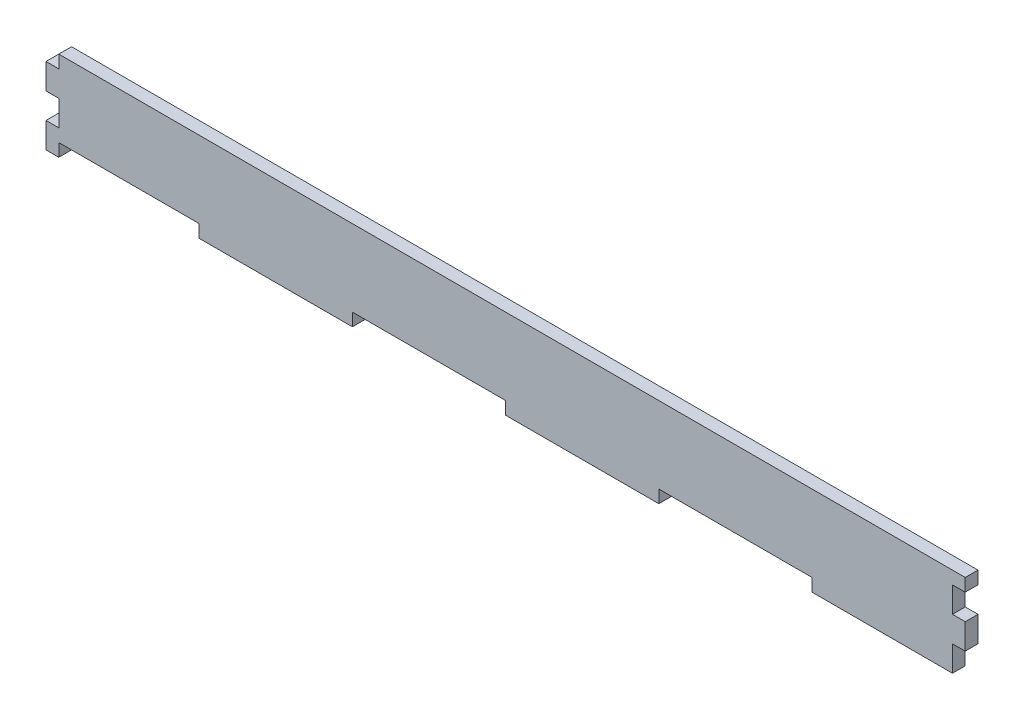
ISO-10303-21;
HEADER;
FILE_DESCRIPTION(('STEP AP214'),'2;1');
FILE_NAME('part.step','',(''),(''),'','','');
FILE_SCHEMA(('AUTOMOTIVE_DESIGN { 1 0 10303 214 1 1 1 1 }'));
ENDSEC;
DATA;
#1=APPLICATION_CONTEXT('core data for automotive mechanical design processes');
#2=APPLICATION_PROTOCOL_DEFINITION('international standard','automotive_design',2000,#1);
#3=PRODUCT_CONTEXT('',#1,'mechanical');
#4=PRODUCT('Part','Part','',(#3));
#5=PRODUCT_RELATED_PRODUCT_CATEGORY('part','',(#4));
#6=PRODUCT_DEFINITION_FORMATION('','',#4);
#7=PRODUCT_DEFINITION_CONTEXT('part definition',#1,'design');
#8=PRODUCT_DEFINITION('design','',#6,#7);
#9=PRODUCT_DEFINITION_SHAPE('','',#8);
#10=(LENGTH_UNIT() NAMED_UNIT(*) SI_UNIT(.MILLI.,.METRE.));
#11=(NAMED_UNIT(*) PLANE_ANGLE_UNIT() SI_UNIT($,.RADIAN.));
#12=(NAMED_UNIT(*) SI_UNIT($,.STERADIAN.) SOLID_ANGLE_UNIT());
#13=UNCERTAINTY_MEASURE_WITH_UNIT(LENGTH_MEASURE(1.E-05),#10,'distance_accuracy_value','');
#14=(GEOMETRIC_REPRESENTATION_CONTEXT(3) GLOBAL_UNCERTAINTY_ASSIGNED_CONTEXT((#13)) GLOBAL_UNIT_ASSIGNED_CONTEXT((#10,
#11,#12)) REPRESENTATION_CONTEXT('',''));
#15=CARTESIAN_POINT('',(0.,0.,0.));
#16=DIRECTION('',(0.,0.,1.));
#17=DIRECTION('',(1.,0.,0.));
#18=AXIS2_PLACEMENT_3D('',#15,#16,#17);
#19=CARTESIAN_POINT('',(111.125,-3.40005801291455E-12,3.175));
#20=DIRECTION('',(1.,0.,0.));
#21=DIRECTION('',(0.,1.,0.));
#22=AXIS2_PLACEMENT_3D('',#19,#20,#21);
#23=PLANE('',#22);
#24=DIRECTION('',(0.,-1.,0.));
#25=VECTOR('',#24,1.);
#26=CARTESIAN_POINT('',(111.125,-3.40005801291455E-12,0.));
#27=LINE('',#26,#25);
#28=CARTESIAN_POINT('',(111.125,-6.35,0.));
#29=VERTEX_POINT('',#28);
#30=CARTESIAN_POINT('',(111.125,-12.7,0.));
#31=VERTEX_POINT('',#30);
#32=EDGE_CURVE('E254',#29,#31,#27,.T.);
#33=ORIENTED_EDGE('',*,*,#32,.F.);
#34=DIRECTION('',(0.,0.,-1.));
#35=VECTOR('',#34,1.);
#36=CARTESIAN_POINT('',(111.125,-6.35,3.175));
#37=LINE('',#36,#35);
#38=CARTESIAN_POINT('',(111.125,-6.35,3.175));
#39=VERTEX_POINT('',#38);
#40=EDGE_CURVE('E11',#39,#29,#37,.T.);
#41=ORIENTED_EDGE('',*,*,#40,.F.);
#42=DIRECTION('',(0.,-1.,0.));
#43=VECTOR('',#42,1.);
#44=CARTESIAN_POINT('',(111.125,-3.40005801291455E-12,3.175));
#45=LINE('',#44,#43);
#46=CARTESIAN_POINT('',(111.125,-12.7,3.175));
#47=VERTEX_POINT('',#46);
#48=EDGE_CURVE('E322',#39,#47,#45,.T.);
#49=ORIENTED_EDGE('',*,*,#48,.T.);
#50=DIRECTION('',(0.,0.,-1.));
#51=VECTOR('',#50,1.);
#52=CARTESIAN_POINT('',(111.125,-12.7,3.175));
#53=LINE('',#52,#51);
#54=EDGE_CURVE('E148',#47,#31,#53,.T.);
#55=ORIENTED_EDGE('',*,*,#54,.T.);
#56=EDGE_LOOP('',(#33,#41,#49,#55));
#57=FACE_BOUND('',#56,.T.);
#58=ADVANCED_FACE('F38',(#57),#23,.T.);
#59=CARTESIAN_POINT('',(0.,-6.34999999999997,3.175));
#60=DIRECTION('',(0.,-1.,0.));
#61=DIRECTION('',(1.,0.,0.));
#62=AXIS2_PLACEMENT_3D('',#59,#60,#61);
#63=PLANE('',#62);
#64=DIRECTION('',(-1.,0.,0.));
#65=VECTOR('',#64,1.);
#66=CARTESIAN_POINT('',(0.,-6.34999999999997,0.));
#67=LINE('',#66,#65);
#68=CARTESIAN_POINT('',(114.3,-6.35,0.));
#69=VERTEX_POINT('',#68);
#70=EDGE_CURVE('E257',#69,#29,#67,.T.);
#71=ORIENTED_EDGE('',*,*,#70,.F.);
#72=DIRECTION('',(0.,0.,-1.));
#73=VECTOR('',#72,1.);
#74=CARTESIAN_POINT('',(114.3,-6.35,3.175));
#75=LINE('',#74,#73);
#76=CARTESIAN_POINT('',(114.3,-6.35,3.175));
#77=VERTEX_POINT('',#76);
#78=EDGE_CURVE('E46',#77,#69,#75,.T.);
#79=ORIENTED_EDGE('',*,*,#78,.F.);
#80=DIRECTION('',(-1.,0.,0.));
#81=VECTOR('',#80,1.);
#82=CARTESIAN_POINT('',(0.,-6.34999999999997,3.175));
#83=LINE('',#82,#81);
#84=EDGE_CURVE('E399',#77,#39,#83,.T.);
#85=ORIENTED_EDGE('',*,*,#84,.T.);
#86=ORIENTED_EDGE('',*,*,#40,.T.);
#87=EDGE_LOOP('',(#71,#79,#85,#86));
#88=FACE_BOUND('',#87,.T.);
#89=ADVANCED_FACE('F385',(#88),#63,.T.);
#90=CARTESIAN_POINT('',(114.3,0.,3.175));
#91=DIRECTION('',(1.,0.,0.));
#92=DIRECTION('',(0.,0.,-1.));
#93=AXIS2_PLACEMENT_3D('',#90,#91,#92);
#94=PLANE('',#93);
#95=DIRECTION('',(0.,-1.,0.));
#96=VECTOR('',#95,1.);
#97=CARTESIAN_POINT('',(114.3,0.,0.));
#98=LINE('',#97,#96);
#99=CARTESIAN_POINT('',(114.3,0.,0.));
#100=VERTEX_POINT('',#99);
#101=EDGE_CURVE('E260',#100,#69,#98,.T.);
#102=ORIENTED_EDGE('',*,*,#101,.F.);
#103=DIRECTION('',(0.,0.,-1.));
#104=VECTOR('',#103,1.);
#105=CARTESIAN_POINT('',(114.3,0.,3.175));
#106=LINE('',#105,#104);
#107=CARTESIAN_POINT('',(114.3,0.,3.175));
#108=VERTEX_POINT('',#107);
#109=EDGE_CURVE('E374',#108,#100,#106,.T.);
#110=ORIENTED_EDGE('',*,*,#109,.F.);
#111=DIRECTION('',(0.,-1.,0.));
#112=VECTOR('',#111,1.);
#113=CARTESIAN_POINT('',(114.3,0.,3.175));
#114=LINE('',#113,#112);
#115=EDGE_CURVE('E381',#108,#77,#114,.T.);
#116=ORIENTED_EDGE('',*,*,#115,.T.);
#117=ORIENTED_EDGE('',*,*,#78,.T.);
#118=EDGE_LOOP('',(#102,#110,#116,#117));
#119=FACE_BOUND('',#118,.T.);
#120=ADVANCED_FACE('F379',(#119),#94,.T.);
#121=CARTESIAN_POINT('',(0.,0.,3.175));
#122=DIRECTION('',(0.,-1.,0.));
#123=DIRECTION('',(1.,0.,0.));
#124=AXIS2_PLACEMENT_3D('',#121,#122,#123);
#125=PLANE('',#124);
#126=DIRECTION('',(-1.,0.,0.));
#127=VECTOR('',#126,1.);
#128=CARTESIAN_POINT('',(0.,0.,0.));
#129=LINE('',#128,#127);
#130=CARTESIAN_POINT('',(111.125,0.,0.));
#131=VERTEX_POINT('',#130);
#132=EDGE_CURVE('E263',#100,#131,#129,.T.);
#133=ORIENTED_EDGE('',*,*,#132,.T.);
#134=DIRECTION('',(0.,0.,-1.));
#135=VECTOR('',#134,1.);
#136=CARTESIAN_POINT('',(111.125,0.,3.175));
#137=LINE('',#136,#135);
#138=CARTESIAN_POINT('',(111.125,0.,3.175));
#139=VERTEX_POINT('',#138);
#140=EDGE_CURVE('E372',#139,#131,#137,.T.);
#141=ORIENTED_EDGE('',*,*,#140,.F.);
#142=DIRECTION('',(-1.,0.,0.));
#143=VECTOR('',#142,1.);
#144=CARTESIAN_POINT('',(0.,0.,3.175));
#145=LINE('',#144,#143);
#146=EDGE_CURVE('E395',#108,#139,#145,.T.);
#147=ORIENTED_EDGE('',*,*,#146,.F.);
#148=ORIENTED_EDGE('',*,*,#109,.T.);
#149=EDGE_LOOP('',(#133,#141,#147,#148));
#150=FACE_BOUND('',#149,.T.);
#151=ADVANCED_FACE('F392',(#150),#125,.F.);
#152=CARTESIAN_POINT('',(111.125,-3.40005801291455E-12,3.175));
#153=DIRECTION('',(1.,0.,0.));
#154=DIRECTION('',(0.,1.,0.));
#155=AXIS2_PLACEMENT_3D('',#152,#153,#154);
#156=PLANE('',#155);
#157=DIRECTION('',(0.,-1.,0.));
#158=VECTOR('',#157,1.);
#159=CARTESIAN_POINT('',(111.125,-3.40005801291455E-12,0.));
#160=LINE('',#159,#158);
#161=CARTESIAN_POINT('',(111.125,6.35,0.));
#162=VERTEX_POINT('',#161);
#163=EDGE_CURVE('E266',#162,#131,#160,.T.);
#164=ORIENTED_EDGE('',*,*,#163,.F.);
#165=DIRECTION('',(0.,0.,-1.));
#166=VECTOR('',#165,1.);
#167=CARTESIAN_POINT('',(111.125,6.35,3.175));
#168=LINE('',#167,#166);
#169=CARTESIAN_POINT('',(111.125,6.35,3.175));
#170=VERTEX_POINT('',#169);
#171=EDGE_CURVE('E370',#170,#162,#168,.T.);
#172=ORIENTED_EDGE('',*,*,#171,.F.);
#173=DIRECTION('',(0.,-1.,0.));
#174=VECTOR('',#173,1.);
#175=CARTESIAN_POINT('',(111.125,-3.40005801291455E-12,3.175));
#176=LINE('',#175,#174);
#177=EDGE_CURVE('E397',#170,#139,#176,.T.);
#178=ORIENTED_EDGE('',*,*,#177,.T.);
#179=ORIENTED_EDGE('',*,*,#140,.T.);
#180=EDGE_LOOP('',(#164,#172,#178,#179));
#181=FACE_BOUND('',#180,.T.);
#182=ADVANCED_FACE('F792',(#181),#156,.T.);
#183=CARTESIAN_POINT('',(0.,6.35000000000003,3.175));
#184=DIRECTION('',(0.,-1.,0.));
#185=DIRECTION('',(1.,0.,0.));
#186=AXIS2_PLACEMENT_3D('',#183,#184,#185);
#187=PLANE('',#186);
#188=DIRECTION('',(-1.,0.,0.));
#189=VECTOR('',#188,1.);
#190=CARTESIAN_POINT('',(0.,6.35000000000003,0.));
#191=LINE('',#190,#189);
#192=CARTESIAN_POINT('',(114.3,6.35,0.));
#193=VERTEX_POINT('',#192);
#194=EDGE_CURVE('E269',#193,#162,#191,.T.);
#195=ORIENTED_EDGE('',*,*,#194,.F.);
#196=DIRECTION('',(0.,0.,-1.));
#197=VECTOR('',#196,1.);
#198=CARTESIAN_POINT('',(114.3,6.35,3.175));
#199=LINE('',#198,#197);
#200=CARTESIAN_POINT('',(114.3,6.35,3.175));
#201=VERTEX_POINT('',#200);
#202=EDGE_CURVE('E368',#201,#193,#199,.T.);
#203=ORIENTED_EDGE('',*,*,#202,.F.);
#204=DIRECTION('',(-1.,0.,0.));
#205=VECTOR('',#204,1.);
#206=CARTESIAN_POINT('',(0.,6.35000000000003,3.175));
#207=LINE('',#206,#205);
#208=EDGE_CURVE('E405',#201,#170,#207,.T.);
#209=ORIENTED_EDGE('',*,*,#208,.T.);
#210=ORIENTED_EDGE('',*,*,#171,.T.);
#211=EDGE_LOOP('',(#195,#203,#209,#210));
#212=FACE_BOUND('',#211,.T.);
#213=ADVANCED_FACE('F780',(#212),#187,.T.);
#214=CARTESIAN_POINT('',(114.3,0.,3.175));
#215=DIRECTION('',(1.,0.,0.));
#216=DIRECTION('',(0.,0.,-1.));
#217=AXIS2_PLACEMENT_3D('',#214,#215,#216);
#218=PLANE('',#217);
#219=DIRECTION('',(0.,-1.,0.));
#220=VECTOR('',#219,1.);
#221=CARTESIAN_POINT('',(114.3,0.,0.));
#222=LINE('',#221,#220);
#223=CARTESIAN_POINT('',(114.3,9.525,0.));
#224=VERTEX_POINT('',#223);
#225=EDGE_CURVE('E272',#224,#193,#222,.T.);
#226=ORIENTED_EDGE('',*,*,#225,.F.);
#227=DIRECTION('',(0.,0.,-1.));
#228=VECTOR('',#227,1.);
#229=CARTESIAN_POINT('',(114.3,9.525,3.175));
#230=LINE('',#229,#228);
#231=CARTESIAN_POINT('',(114.3,9.525,3.175));
#232=VERTEX_POINT('',#231);
#233=EDGE_CURVE('E366',#232,#224,#230,.T.);
#234=ORIENTED_EDGE('',*,*,#233,.F.);
#235=DIRECTION('',(0.,-1.,0.));
#236=VECTOR('',#235,1.);
#237=CARTESIAN_POINT('',(114.3,0.,3.175));
#238=LINE('',#237,#236);
#239=EDGE_CURVE('E408',#232,#201,#238,.T.);
#240=ORIENTED_EDGE('',*,*,#239,.T.);
#241=ORIENTED_EDGE('',*,*,#202,.T.);
#242=EDGE_LOOP('',(#226,#234,#240,#241));
#243=FACE_BOUND('',#242,.T.);
#244=ADVANCED_FACE('F768',(#243),#218,.T.);
#245=CARTESIAN_POINT('',(0.,9.525,3.175));
#246=DIRECTION('',(0.,1.,0.));
#247=DIRECTION('',(0.,0.,1.));
#248=AXIS2_PLACEMENT_3D('',#245,#246,#247);
#249=PLANE('',#248);
#250=DIRECTION('',(1.,0.,0.));
#251=VECTOR('',#250,1.);
#252=CARTESIAN_POINT('',(0.,9.525,0.));
#253=LINE('',#252,#251);
#254=CARTESIAN_POINT('',(-111.125,9.525,0.));
#255=VERTEX_POINT('',#254);
#256=EDGE_CURVE('E275',#255,#224,#253,.T.);
#257=ORIENTED_EDGE('',*,*,#256,.F.);
#258=DIRECTION('',(0.,0.,-1.));
#259=VECTOR('',#258,1.);
#260=CARTESIAN_POINT('',(-111.125,9.525,3.175));
#261=LINE('',#260,#259);
#262=CARTESIAN_POINT('',(-111.125,9.525,3.175));
#263=VERTEX_POINT('',#262);
#264=EDGE_CURVE('E364',#263,#255,#261,.T.);
#265=ORIENTED_EDGE('',*,*,#264,.F.);
#266=DIRECTION('',(1.,0.,0.));
#267=VECTOR('',#266,1.);
#268=CARTESIAN_POINT('',(0.,9.525,3.175));
#269=LINE('',#268,#267);
#270=EDGE_CURVE('E411',#263,#232,#269,.T.);
#271=ORIENTED_EDGE('',*,*,#270,.T.);
#272=ORIENTED_EDGE('',*,*,#233,.T.);
#273=EDGE_LOOP('',(#257,#265,#271,#272));
#274=FACE_BOUND('',#273,.T.);
#275=ADVANCED_FACE('F758',(#274),#249,.T.);
#276=CARTESIAN_POINT('',(-111.125,0.,3.175));
#277=DIRECTION('',(1.,0.,0.));
#278=DIRECTION('',(0.,0.,-1.));
#279=AXIS2_PLACEMENT_3D('',#276,#277,#278);
#280=PLANE('',#279);
#281=DIRECTION('',(0.,-1.,0.));
#282=VECTOR('',#281,1.);
#283=CARTESIAN_POINT('',(-111.125,0.,0.));
#284=LINE('',#283,#282);
#285=CARTESIAN_POINT('',(-111.125,6.35,0.));
#286=VERTEX_POINT('',#285);
#287=EDGE_CURVE('E278',#255,#286,#284,.T.);
#288=ORIENTED_EDGE('',*,*,#287,.T.);
#289=DIRECTION('',(0.,0.,-1.));
#290=VECTOR('',#289,1.);
#291=CARTESIAN_POINT('',(-111.125,6.35,3.175));
#292=LINE('',#291,#290);
#293=CARTESIAN_POINT('',(-111.125,6.35,3.175));
#294=VERTEX_POINT('',#293);
#295=EDGE_CURVE('E362',#294,#286,#292,.T.);
#296=ORIENTED_EDGE('',*,*,#295,.F.);
#297=DIRECTION('',(0.,-1.,0.));
#298=VECTOR('',#297,1.);
#299=CARTESIAN_POINT('',(-111.125,0.,3.175));
#300=LINE('',#299,#298);
#301=EDGE_CURVE('E414',#263,#294,#300,.T.);
#302=ORIENTED_EDGE('',*,*,#301,.F.);
#303=ORIENTED_EDGE('',*,*,#264,.T.);
#304=EDGE_LOOP('',(#288,#296,#302,#303));
#305=FACE_BOUND('',#304,.T.);
#306=ADVANCED_FACE('F716',(#305),#280,.F.);
#307=CARTESIAN_POINT('',(0.,6.35000000000003,3.175));
#308=DIRECTION('',(0.,1.,0.));
#309=DIRECTION('',(-1.,0.,0.));
#310=AXIS2_PLACEMENT_3D('',#307,#308,#309);
#311=PLANE('',#310);
#312=DIRECTION('',(1.,0.,0.));
#313=VECTOR('',#312,1.);
#314=CARTESIAN_POINT('',(0.,6.35000000000003,0.));
#315=LINE('',#314,#313);
#316=CARTESIAN_POINT('',(-114.3,6.35,0.));
#317=VERTEX_POINT('',#316);
#318=EDGE_CURVE('E281',#317,#286,#315,.T.);
#319=ORIENTED_EDGE('',*,*,#318,.F.);
#320=DIRECTION('',(0.,0.,-1.));
#321=VECTOR('',#320,1.);
#322=CARTESIAN_POINT('',(-114.3,6.35,3.175));
#323=LINE('',#322,#321);
#324=CARTESIAN_POINT('',(-114.3,6.35,3.175));
#325=VERTEX_POINT('',#324);
#326=EDGE_CURVE('E360',#325,#317,#323,.T.);
#327=ORIENTED_EDGE('',*,*,#326,.F.);
#328=DIRECTION('',(1.,0.,0.));
#329=VECTOR('',#328,1.);
#330=CARTESIAN_POINT('',(0.,6.35000000000003,3.175));
#331=LINE('',#330,#329);
#332=EDGE_CURVE('E416',#325,#294,#331,.T.);
#333=ORIENTED_EDGE('',*,*,#332,.T.);
#334=ORIENTED_EDGE('',*,*,#295,.T.);
#335=EDGE_LOOP('',(#319,#327,#333,#334));
#336=FACE_BOUND('',#335,.T.);
#337=ADVANCED_FACE('F737',(#336),#311,.T.);
#338=CARTESIAN_POINT('',(-114.3,0.,3.175));
#339=DIRECTION('',(1.,0.,0.));
#340=DIRECTION('',(0.,0.,-1.));
#341=AXIS2_PLACEMENT_3D('',#338,#339,#340);
#342=PLANE('',#341);
#343=DIRECTION('',(0.,-1.,0.));
#344=VECTOR('',#343,1.);
#345=CARTESIAN_POINT('',(-114.3,0.,0.));
#346=LINE('',#345,#344);
#347=CARTESIAN_POINT('',(-114.3,0.,0.));
#348=VERTEX_POINT('',#347);
#349=EDGE_CURVE('E285',#317,#348,#346,.T.);
#350=ORIENTED_EDGE('',*,*,#349,.T.);
#351=DIRECTION('',(0.,0.,-1.));
#352=VECTOR('',#351,1.);
#353=CARTESIAN_POINT('',(-114.3,0.,3.175));
#354=LINE('',#353,#352);
#355=CARTESIAN_POINT('',(-114.3,0.,3.175));
#356=VERTEX_POINT('',#355);
#357=EDGE_CURVE('E357',#356,#348,#354,.T.);
#358=ORIENTED_EDGE('',*,*,#357,.F.);
#359=DIRECTION('',(0.,-1.,0.));
#360=VECTOR('',#359,1.);
#361=CARTESIAN_POINT('',(-114.3,0.,3.175));
#362=LINE('',#361,#360);
#363=EDGE_CURVE('E420',#325,#356,#362,.T.);
#364=ORIENTED_EDGE('',*,*,#363,.F.);
#365=ORIENTED_EDGE('',*,*,#326,.T.);
#366=EDGE_LOOP('',(#350,#358,#364,#365));
#367=FACE_BOUND('',#366,.T.);
#368=ADVANCED_FACE('F725',(#367),#342,.F.);
#369=CARTESIAN_POINT('',(0.,0.,3.175));
#370=DIRECTION('',(0.,1.,0.));
#371=DIRECTION('',(-1.,0.,0.));
#372=AXIS2_PLACEMENT_3D('',#369,#370,#371);
#373=PLANE('',#372);
#374=DIRECTION('',(1.,0.,0.));
#375=VECTOR('',#374,1.);
#376=CARTESIAN_POINT('',(0.,0.,0.));
#377=LINE('',#376,#375);
#378=CARTESIAN_POINT('',(-111.125,0.,0.));
#379=VERTEX_POINT('',#378);
#380=EDGE_CURVE('E287',#348,#379,#377,.T.);
#381=ORIENTED_EDGE('',*,*,#380,.T.);
#382=DIRECTION('',(0.,0.,-1.));
#383=VECTOR('',#382,1.);
#384=CARTESIAN_POINT('',(-111.125,0.,3.175));
#385=LINE('',#384,#383);
#386=CARTESIAN_POINT('',(-111.125,0.,3.175));
#387=VERTEX_POINT('',#386);
#388=EDGE_CURVE('E354',#387,#379,#385,.T.);
#389=ORIENTED_EDGE('',*,*,#388,.F.);
#390=DIRECTION('',(1.,0.,0.));
#391=VECTOR('',#390,1.);
#392=CARTESIAN_POINT('',(0.,0.,3.175));
#393=LINE('',#392,#391);
#394=EDGE_CURVE('E422',#356,#387,#393,.T.);
#395=ORIENTED_EDGE('',*,*,#394,.F.);
#396=ORIENTED_EDGE('',*,*,#357,.T.);
#397=EDGE_LOOP('',(#381,#389,#395,#396));
#398=FACE_BOUND('',#397,.T.);
#399=ADVANCED_FACE('F713',(#398),#373,.F.);
#400=CARTESIAN_POINT('',(-111.125,-6.35,0.));
#401=VERTEX_POINT('',#400);
#402=EDGE_CURVE('E282',#379,#401,#284,.T.);
#403=ORIENTED_EDGE('',*,*,#402,.T.);
#404=DIRECTION('',(0.,0.,-1.));
#405=VECTOR('',#404,1.);
#406=CARTESIAN_POINT('',(-111.125,-6.35,3.175));
#407=LINE('',#406,#405);
#408=CARTESIAN_POINT('',(-111.125,-6.35,3.175));
#409=VERTEX_POINT('',#408);
#410=EDGE_CURVE('E352',#409,#401,#407,.T.);
#411=ORIENTED_EDGE('',*,*,#410,.F.);
#412=EDGE_CURVE('E417',#387,#409,#300,.T.);
#413=ORIENTED_EDGE('',*,*,#412,.F.);
#414=ORIENTED_EDGE('',*,*,#388,.T.);
#415=EDGE_LOOP('',(#403,#411,#413,#414));
#416=FACE_BOUND('',#415,.T.);
#417=ADVANCED_FACE('F701',(#416),#280,.F.);
#418=CARTESIAN_POINT('',(0.,-6.34999999999997,3.175));
#419=DIRECTION('',(0.,1.,0.));
#420=DIRECTION('',(-1.,0.,0.));
#421=AXIS2_PLACEMENT_3D('',#418,#419,#420);
#422=PLANE('',#421);
#423=DIRECTION('',(1.,0.,0.));
#424=VECTOR('',#423,1.);
#425=CARTESIAN_POINT('',(0.,-6.34999999999997,0.));
#426=LINE('',#425,#424);
#427=CARTESIAN_POINT('',(-114.3,-6.35,0.));
#428=VERTEX_POINT('',#427);
#429=EDGE_CURVE('E289',#428,#401,#426,.T.);
#430=ORIENTED_EDGE('',*,*,#429,.F.);
#431=DIRECTION('',(0.,0.,-1.));
#432=VECTOR('',#431,1.);
#433=CARTESIAN_POINT('',(-114.3,-6.35,3.175));
#434=LINE('',#433,#432);
#435=CARTESIAN_POINT('',(-114.3,-6.35,3.175));
#436=VERTEX_POINT('',#435);
#437=EDGE_CURVE('E350',#436,#428,#434,.T.);
#438=ORIENTED_EDGE('',*,*,#437,.F.);
#439=DIRECTION('',(1.,0.,0.));
#440=VECTOR('',#439,1.);
#441=CARTESIAN_POINT('',(0.,-6.34999999999997,3.175));
#442=LINE('',#441,#440);
#443=EDGE_CURVE('E424',#436,#409,#442,.T.);
#444=ORIENTED_EDGE('',*,*,#443,.T.);
#445=ORIENTED_EDGE('',*,*,#410,.T.);
#446=EDGE_LOOP('',(#430,#438,#444,#445));
#447=FACE_BOUND('',#446,.T.);
#448=ADVANCED_FACE('F689',(#447),#422,.T.);
#449=CARTESIAN_POINT('',(-114.3,0.,3.175));
#450=DIRECTION('',(1.,0.,0.));
#451=DIRECTION('',(0.,0.,-1.));
#452=AXIS2_PLACEMENT_3D('',#449,#450,#451);
#453=PLANE('',#452);
#454=DIRECTION('',(0.,-1.,0.));
#455=VECTOR('',#454,1.);
#456=CARTESIAN_POINT('',(-114.3,0.,0.));
#457=LINE('',#456,#455);
#458=CARTESIAN_POINT('',(-114.3,-12.7,0.));
#459=VERTEX_POINT('',#458);
#460=EDGE_CURVE('E292',#428,#459,#457,.T.);
#461=ORIENTED_EDGE('',*,*,#460,.T.);
#462=DIRECTION('',(0.,0.,-1.));
#463=VECTOR('',#462,1.);
#464=CARTESIAN_POINT('',(-114.3,-12.7,3.175));
#465=LINE('',#464,#463);
#466=CARTESIAN_POINT('',(-114.3,-12.7,3.175));
#467=VERTEX_POINT('',#466);
#468=EDGE_CURVE('E347',#467,#459,#465,.T.);
#469=ORIENTED_EDGE('',*,*,#468,.F.);
#470=DIRECTION('',(0.,-1.,0.));
#471=VECTOR('',#470,1.);
#472=CARTESIAN_POINT('',(-114.3,0.,3.175));
#473=LINE('',#472,#471);
#474=EDGE_CURVE('E427',#436,#467,#473,.T.);
#475=ORIENTED_EDGE('',*,*,#474,.F.);
#476=ORIENTED_EDGE('',*,*,#437,.T.);
#477=EDGE_LOOP('',(#461,#469,#475,#476));
#478=FACE_BOUND('',#477,.T.);
#479=ADVANCED_FACE('F678',(#478),#453,.F.);
#480=CARTESIAN_POINT('',(0.,-12.7,3.175));
#481=DIRECTION('',(0.,1.,0.));
#482=DIRECTION('',(0.,0.,1.));
#483=AXIS2_PLACEMENT_3D('',#480,#481,#482);
#484=PLANE('',#483);
#485=DIRECTION('',(1.,0.,0.));
#486=VECTOR('',#485,1.);
#487=CARTESIAN_POINT('',(0.,-12.7,0.));
#488=LINE('',#487,#486);
#489=CARTESIAN_POINT('',(-111.125,-12.7,0.));
#490=VERTEX_POINT('',#489);
#491=EDGE_CURVE('E294',#459,#490,#488,.T.);
#492=ORIENTED_EDGE('',*,*,#491,.T.);
#493=DIRECTION('',(0.,0.,-1.));
#494=VECTOR('',#493,1.);
#495=CARTESIAN_POINT('',(-111.125,-12.7,3.175));
#496=LINE('',#495,#494);
#497=CARTESIAN_POINT('',(-111.125,-12.7,3.175));
#498=VERTEX_POINT('',#497);
#499=EDGE_CURVE('E345',#498,#490,#496,.T.);
#500=ORIENTED_EDGE('',*,*,#499,.F.);
#501=DIRECTION('',(1.,0.,0.));
#502=VECTOR('',#501,1.);
#503=CARTESIAN_POINT('',(0.,-12.7,3.175));
#504=LINE('',#503,#502);
#505=EDGE_CURVE('E429',#467,#498,#504,.T.);
#506=ORIENTED_EDGE('',*,*,#505,.F.);
#507=ORIENTED_EDGE('',*,*,#468,.T.);
#508=EDGE_LOOP('',(#492,#500,#506,#507));
#509=FACE_BOUND('',#508,.T.);
#510=ADVANCED_FACE('F667',(#509),#484,.F.);
#511=CARTESIAN_POINT('',(-111.125,0.,3.175));
#512=DIRECTION('',(1.,0.,0.));
#513=DIRECTION('',(0.,0.,-1.));
#514=AXIS2_PLACEMENT_3D('',#511,#512,#513);
#515=PLANE('',#514);
#516=DIRECTION('',(0.,-1.,0.));
#517=VECTOR('',#516,1.);
#518=CARTESIAN_POINT('',(-111.125,0.,0.));
#519=LINE('',#518,#517);
#520=CARTESIAN_POINT('',(-111.125,-9.525,0.));
#521=VERTEX_POINT('',#520);
#522=EDGE_CURVE('E297',#521,#490,#519,.T.);
#523=ORIENTED_EDGE('',*,*,#522,.F.);
#524=DIRECTION('',(0.,0.,-1.));
#525=VECTOR('',#524,1.);
#526=CARTESIAN_POINT('',(-111.125,-9.525,3.175));
#527=LINE('',#526,#525);
#528=CARTESIAN_POINT('',(-111.125,-9.525,3.175));
#529=VERTEX_POINT('',#528);
#530=EDGE_CURVE('E343',#529,#521,#527,.T.);
#531=ORIENTED_EDGE('',*,*,#530,.F.);
#532=DIRECTION('',(0.,-1.,0.));
#533=VECTOR('',#532,1.);
#534=CARTESIAN_POINT('',(-111.125,0.,3.175));
#535=LINE('',#534,#533);
#536=EDGE_CURVE('E431',#529,#498,#535,.T.);
#537=ORIENTED_EDGE('',*,*,#536,.T.);
#538=ORIENTED_EDGE('',*,*,#499,.T.);
#539=EDGE_LOOP('',(#523,#531,#537,#538));
#540=FACE_BOUND('',#539,.T.);
#541=ADVANCED_FACE('F657',(#540),#515,.T.);
#542=CARTESIAN_POINT('',(0.,-9.52500000000006,3.175));
#543=DIRECTION('',(0.,1.,0.));
#544=DIRECTION('',(-1.,0.,0.));
#545=AXIS2_PLACEMENT_3D('',#542,#543,#544);
#546=PLANE('',#545);
#547=DIRECTION('',(1.,0.,0.));
#548=VECTOR('',#547,1.);
#549=CARTESIAN_POINT('',(0.,-9.52500000000006,0.));
#550=LINE('',#549,#548);
#551=CARTESIAN_POINT('',(-76.2,-9.52500000000002,0.));
#552=VERTEX_POINT('',#551);
#553=EDGE_CURVE('E300',#521,#552,#550,.T.);
#554=ORIENTED_EDGE('',*,*,#553,.T.);
#555=DIRECTION('',(0.,0.,-1.));
#556=VECTOR('',#555,1.);
#557=CARTESIAN_POINT('',(-76.2,-9.52500000000002,3.175));
#558=LINE('',#557,#556);
#559=CARTESIAN_POINT('',(-76.2,-9.52500000000002,3.175));
#560=VERTEX_POINT('',#559);
#561=EDGE_CURVE('E341',#560,#552,#558,.T.);
#562=ORIENTED_EDGE('',*,*,#561,.F.);
#563=DIRECTION('',(1.,0.,0.));
#564=VECTOR('',#563,1.);
#565=CARTESIAN_POINT('',(0.,-9.52500000000006,3.175));
#566=LINE('',#565,#564);
#567=EDGE_CURVE('E237',#529,#560,#566,.T.);
#568=ORIENTED_EDGE('',*,*,#567,.F.);
#569=ORIENTED_EDGE('',*,*,#530,.T.);
#570=EDGE_LOOP('',(#554,#562,#568,#569));
#571=FACE_BOUND('',#570,.T.);
#572=ADVANCED_FACE('F473',(#571),#546,.F.);
#573=CARTESIAN_POINT('',(-76.2000000000007,-5.66213742558839E-12,3.175));
#574=DIRECTION('',(-1.,0.,0.));
#575=DIRECTION('',(0.,-1.,0.));
#576=AXIS2_PLACEMENT_3D('',#573,#574,#575);
#577=PLANE('',#576);
#578=DIRECTION('',(0.,1.,0.));
#579=VECTOR('',#578,1.);
#580=CARTESIAN_POINT('',(-76.2000000000007,-5.66213742558839E-12,0.));
#581=LINE('',#580,#579);
#582=CARTESIAN_POINT('',(-76.1999999999998,-12.7,0.));
#583=VERTEX_POINT('',#582);
#584=EDGE_CURVE('E303',#583,#552,#581,.T.);
#585=ORIENTED_EDGE('',*,*,#584,.F.);
#586=DIRECTION('',(0.,0.,-1.));
#587=VECTOR('',#586,1.);
#588=CARTESIAN_POINT('',(-76.1999999999998,-12.7,3.175));
#589=LINE('',#588,#587);
#590=CARTESIAN_POINT('',(-76.1999999999998,-12.7,3.175));
#591=VERTEX_POINT('',#590);
#592=EDGE_CURVE('E339',#591,#583,#589,.T.);
#593=ORIENTED_EDGE('',*,*,#592,.F.);
#594=DIRECTION('',(0.,1.,0.));
#595=VECTOR('',#594,1.);
#596=CARTESIAN_POINT('',(-76.2000000000007,-5.66213742558839E-12,3.175));
#597=LINE('',#596,#595);
#598=EDGE_CURVE('E434',#591,#560,#597,.T.);
#599=ORIENTED_EDGE('',*,*,#598,.T.);
#600=ORIENTED_EDGE('',*,*,#561,.T.);
#601=EDGE_LOOP('',(#585,#593,#599,#600));
#602=FACE_BOUND('',#601,.T.);
#603=ADVANCED_FACE('F636',(#602),#577,.T.);
#604=CARTESIAN_POINT('',(0.,-12.7,3.175));
#605=DIRECTION('',(0.,1.,0.));
#606=DIRECTION('',(0.,0.,1.));
#607=AXIS2_PLACEMENT_3D('',#604,#605,#606);
#608=PLANE('',#607);
#609=DIRECTION('',(1.,0.,0.));
#610=VECTOR('',#609,1.);
#611=CARTESIAN_POINT('',(0.,-12.7,0.));
#612=LINE('',#611,#610);
#613=CARTESIAN_POINT('',(-38.0999999999997,-12.7,0.));
#614=VERTEX_POINT('',#613);
#615=EDGE_CURVE('E307',#583,#614,#612,.T.);
#616=ORIENTED_EDGE('',*,*,#615,.T.);
#617=DIRECTION('',(0.,0.,-1.));
#618=VECTOR('',#617,1.);
#619=CARTESIAN_POINT('',(-38.0999999999997,-12.7,3.175));
#620=LINE('',#619,#618);
#621=CARTESIAN_POINT('',(-38.0999999999997,-12.7,3.175));
#622=VERTEX_POINT('',#621);
#623=EDGE_CURVE('E336',#622,#614,#620,.T.);
#624=ORIENTED_EDGE('',*,*,#623,.F.);
#625=DIRECTION('',(1.,0.,0.));
#626=VECTOR('',#625,1.);
#627=CARTESIAN_POINT('',(0.,-12.7,3.175));
#628=LINE('',#627,#626);
#629=EDGE_CURVE('E437',#591,#622,#628,.T.);
#630=ORIENTED_EDGE('',*,*,#629,.F.);
#631=ORIENTED_EDGE('',*,*,#592,.T.);
#632=EDGE_LOOP('',(#616,#624,#630,#631));
#633=FACE_BOUND('',#632,.T.);
#634=ADVANCED_FACE('F625',(#633),#608,.F.);
#635=CARTESIAN_POINT('',(-38.0999999999997,0.,3.175));
#636=DIRECTION('',(-1.,0.,0.));
#637=DIRECTION('',(0.,0.,1.));
#638=AXIS2_PLACEMENT_3D('',#635,#636,#637);
#639=PLANE('',#638);
#640=DIRECTION('',(0.,1.,0.));
#641=VECTOR('',#640,1.);
#642=CARTESIAN_POINT('',(-38.0999999999997,0.,0.));
#643=LINE('',#642,#641);
#644=CARTESIAN_POINT('',(-38.0999999999997,-9.52500000000003,0.));
#645=VERTEX_POINT('',#644);
#646=EDGE_CURVE('E309',#614,#645,#643,.T.);
#647=ORIENTED_EDGE('',*,*,#646,.T.);
#648=DIRECTION('',(0.,0.,-1.));
#649=VECTOR('',#648,1.);
#650=CARTESIAN_POINT('',(-38.0999999999997,-9.52500000000003,3.175));
#651=LINE('',#650,#649);
#652=CARTESIAN_POINT('',(-38.0999999999997,-9.52500000000003,3.175));
#653=VERTEX_POINT('',#652);
#654=EDGE_CURVE('E333',#653,#645,#651,.T.);
#655=ORIENTED_EDGE('',*,*,#654,.F.);
#656=DIRECTION('',(0.,1.,0.));
#657=VECTOR('',#656,1.);
#658=CARTESIAN_POINT('',(-38.0999999999997,0.,3.175));
#659=LINE('',#658,#657);
#660=EDGE_CURVE('E439',#622,#653,#659,.T.);
#661=ORIENTED_EDGE('',*,*,#660,.F.);
#662=ORIENTED_EDGE('',*,*,#623,.T.);
#663=EDGE_LOOP('',(#647,#655,#661,#662));
#664=FACE_BOUND('',#663,.T.);
#665=ADVANCED_FACE('F471',(#664),#639,.F.);
#666=CARTESIAN_POINT('',(5.82867087928207E-13,-9.52500000000004,0.));
#667=VERTEX_POINT('',#666);
#668=EDGE_CURVE('E304',#645,#667,#550,.T.);
#669=ORIENTED_EDGE('',*,*,#668,.T.);
#670=DIRECTION('',(0.,0.,-1.));
#671=VECTOR('',#670,1.);
#672=CARTESIAN_POINT('',(5.82867087928207E-13,-9.52500000000004,3.175));
#673=LINE('',#672,#671);
#674=CARTESIAN_POINT('',(5.82867087928207E-13,-9.52500000000004,3.175));
#675=VERTEX_POINT('',#674);
#676=EDGE_CURVE('E331',#675,#667,#673,.T.);
#677=ORIENTED_EDGE('',*,*,#676,.F.);
#678=EDGE_CURVE('E236',#653,#675,#566,.T.);
#679=ORIENTED_EDGE('',*,*,#678,.F.);
#680=ORIENTED_EDGE('',*,*,#654,.T.);
#681=EDGE_LOOP('',(#669,#677,#679,#680));
#682=FACE_BOUND('',#681,.T.);
#683=ADVANCED_FACE('F457',(#682),#546,.F.);
#684=CARTESIAN_POINT('',(5.82867087928207E-13,0.,3.175));
#685=DIRECTION('',(-1.,0.,0.));
#686=DIRECTION('',(0.,0.,1.));
#687=AXIS2_PLACEMENT_3D('',#684,#685,#686);
#688=PLANE('',#687);
#689=DIRECTION('',(0.,1.,0.));
#690=VECTOR('',#689,1.);
#691=CARTESIAN_POINT('',(5.82867087928207E-13,0.,0.));
#692=LINE('',#691,#690);
#693=CARTESIAN_POINT('',(5.82867087928207E-13,-12.7,0.));
#694=VERTEX_POINT('',#693);
#695=EDGE_CURVE('E311',#694,#667,#692,.T.);
#696=ORIENTED_EDGE('',*,*,#695,.F.);
#697=DIRECTION('',(0.,0.,-1.));
#698=VECTOR('',#697,1.);
#699=CARTESIAN_POINT('',(5.82867087928207E-13,-12.7,3.175));
#700=LINE('',#699,#698);
#701=CARTESIAN_POINT('',(5.82867087928207E-13,-12.7,3.175));
#702=VERTEX_POINT('',#701);
#703=EDGE_CURVE('E329',#702,#694,#700,.T.);
#704=ORIENTED_EDGE('',*,*,#703,.F.);
#705=DIRECTION('',(0.,1.,0.));
#706=VECTOR('',#705,1.);
#707=CARTESIAN_POINT('',(5.82867087928207E-13,0.,3.175));
#708=LINE('',#707,#706);
#709=EDGE_CURVE('E441',#702,#675,#708,.T.);
#710=ORIENTED_EDGE('',*,*,#709,.T.);
#711=ORIENTED_EDGE('',*,*,#676,.T.);
#712=EDGE_LOOP('',(#696,#704,#710,#711));
#713=FACE_BOUND('',#712,.T.);
#714=ADVANCED_FACE('F463',(#713),#688,.T.);
#715=CARTESIAN_POINT('',(0.,-12.7,3.175));
#716=DIRECTION('',(0.,1.,0.));
#717=DIRECTION('',(0.,0.,1.));
#718=AXIS2_PLACEMENT_3D('',#715,#716,#717);
#719=PLANE('',#718);
#720=DIRECTION('',(1.,0.,0.));
#721=VECTOR('',#720,1.);
#722=CARTESIAN_POINT('',(0.,-12.7,0.));
#723=LINE('',#722,#721);
#724=CARTESIAN_POINT('',(38.1000000000009,-12.7,0.));
#725=VERTEX_POINT('',#724);
#726=EDGE_CURVE('E314',#694,#725,#723,.T.);
#727=ORIENTED_EDGE('',*,*,#726,.T.);
#728=DIRECTION('',(0.,0.,-1.));
#729=VECTOR('',#728,1.);
#730=CARTESIAN_POINT('',(38.1000000000009,-12.7,3.175));
#731=LINE('',#730,#729);
#732=CARTESIAN_POINT('',(38.1000000000009,-12.7,3.175));
#733=VERTEX_POINT('',#732);
#734=EDGE_CURVE('E326',#733,#725,#731,.T.);
#735=ORIENTED_EDGE('',*,*,#734,.F.);
#736=DIRECTION('',(1.,0.,0.));
#737=VECTOR('',#736,1.);
#738=CARTESIAN_POINT('',(0.,-12.7,3.175));
#739=LINE('',#738,#737);
#740=EDGE_CURVE('E443',#702,#733,#739,.T.);
#741=ORIENTED_EDGE('',*,*,#740,.F.);
#742=ORIENTED_EDGE('',*,*,#703,.T.);
#743=EDGE_LOOP('',(#727,#735,#741,#742));
#744=FACE_BOUND('',#743,.T.);
#745=ADVANCED_FACE('F448',(#744),#719,.F.);
#746=CARTESIAN_POINT('',(38.1000000000009,0.,3.175));
#747=DIRECTION('',(-1.,0.,0.));
#748=DIRECTION('',(0.,0.,1.));
#749=AXIS2_PLACEMENT_3D('',#746,#747,#748);
#750=PLANE('',#749);
#751=DIRECTION('',(0.,1.,0.));
#752=VECTOR('',#751,1.);
#753=CARTESIAN_POINT('',(38.1000000000009,0.,0.));
#754=LINE('',#753,#752);
#755=CARTESIAN_POINT('',(38.1000000000009,-9.52500000000005,0.));
#756=VERTEX_POINT('',#755);
#757=EDGE_CURVE('E316',#725,#756,#754,.T.);
#758=ORIENTED_EDGE('',*,*,#757,.T.);
#759=DIRECTION('',(0.,0.,-1.));
#760=VECTOR('',#759,1.);
#761=CARTESIAN_POINT('',(38.1000000000009,-9.52500000000005,3.175));
#762=LINE('',#761,#760);
#763=CARTESIAN_POINT('',(38.1000000000009,-9.52500000000005,3.175));
#764=VERTEX_POINT('',#763);
#765=EDGE_CURVE('E246',#764,#756,#762,.T.);
#766=ORIENTED_EDGE('',*,*,#765,.F.);
#767=DIRECTION('',(0.,1.,0.));
#768=VECTOR('',#767,1.);
#769=CARTESIAN_POINT('',(38.1000000000009,0.,3.175));
#770=LINE('',#769,#768);
#771=EDGE_CURVE('E231',#733,#764,#770,.T.);
#772=ORIENTED_EDGE('',*,*,#771,.F.);
#773=ORIENTED_EDGE('',*,*,#734,.T.);
#774=EDGE_LOOP('',(#758,#766,#772,#773));
#775=FACE_BOUND('',#774,.T.);
#776=ADVANCED_FACE('F452',(#775),#750,.F.);
#777=CARTESIAN_POINT('',(76.2000000000011,-9.52500000000006,0.));
#778=VERTEX_POINT('',#777);
#779=EDGE_CURVE('E242',#756,#778,#550,.T.);
#780=ORIENTED_EDGE('',*,*,#779,.T.);
#781=DIRECTION('',(0.,0.,-1.));
#782=VECTOR('',#781,1.);
#783=CARTESIAN_POINT('',(76.2000000000011,-9.52500000000006,3.175));
#784=LINE('',#783,#782);
#785=CARTESIAN_POINT('',(76.2000000000011,-9.52500000000006,3.175));
#786=VERTEX_POINT('',#785);
#787=EDGE_CURVE('E239',#786,#778,#784,.T.);
#788=ORIENTED_EDGE('',*,*,#787,.F.);
#789=EDGE_CURVE('E225',#764,#786,#566,.T.);
#790=ORIENTED_EDGE('',*,*,#789,.F.);
#791=ORIENTED_EDGE('',*,*,#765,.T.);
#792=EDGE_LOOP('',(#780,#788,#790,#791));
#793=FACE_BOUND('',#792,.T.);
#794=ADVANCED_FACE('F240',(#793),#546,.F.);
#795=CARTESIAN_POINT('',(76.2000000000011,0.,3.175));
#796=DIRECTION('',(-1.,0.,0.));
#797=DIRECTION('',(0.,0.,1.));
#798=AXIS2_PLACEMENT_3D('',#795,#796,#797);
#799=PLANE('',#798);
#800=DIRECTION('',(0.,1.,0.));
#801=VECTOR('',#800,1.);
#802=CARTESIAN_POINT('',(76.2000000000011,0.,0.));
#803=LINE('',#802,#801);
#804=CARTESIAN_POINT('',(76.2000000000011,-12.7,0.));
#805=VERTEX_POINT('',#804);
#806=EDGE_CURVE('E318',#805,#778,#803,.T.);
#807=ORIENTED_EDGE('',*,*,#806,.F.);
#808=DIRECTION('',(0.,0.,-1.));
#809=VECTOR('',#808,1.);
#810=CARTESIAN_POINT('',(76.2000000000011,-12.7,3.175));
#811=LINE('',#810,#809);
#812=CARTESIAN_POINT('',(76.2000000000011,-12.7,3.175));
#813=VERTEX_POINT('',#812);
#814=EDGE_CURVE('E141',#813,#805,#811,.T.);
#815=ORIENTED_EDGE('',*,*,#814,.F.);
#816=DIRECTION('',(0.,1.,0.));
#817=VECTOR('',#816,1.);
#818=CARTESIAN_POINT('',(76.2000000000011,0.,3.175));
#819=LINE('',#818,#817);
#820=EDGE_CURVE('E229',#813,#786,#819,.T.);
#821=ORIENTED_EDGE('',*,*,#820,.T.);
#822=ORIENTED_EDGE('',*,*,#787,.T.);
#823=EDGE_LOOP('',(#807,#815,#821,#822));
#824=FACE_BOUND('',#823,.T.);
#825=ADVANCED_FACE('F248',(#824),#799,.T.);
#826=CARTESIAN_POINT('',(0.,-12.7,3.175));
#827=DIRECTION('',(0.,1.,0.));
#828=DIRECTION('',(0.,0.,1.));
#829=AXIS2_PLACEMENT_3D('',#826,#827,#828);
#830=PLANE('',#829);
#831=DIRECTION('',(1.,0.,0.));
#832=VECTOR('',#831,1.);
#833=CARTESIAN_POINT('',(0.,-12.7,0.));
#834=LINE('',#833,#832);
#835=EDGE_CURVE('E320',#805,#31,#834,.T.);
#836=ORIENTED_EDGE('',*,*,#835,.T.);
#837=ORIENTED_EDGE('',*,*,#54,.F.);
#838=DIRECTION('',(1.,0.,0.));
#839=VECTOR('',#838,1.);
#840=CARTESIAN_POINT('',(0.,-12.7,3.175));
#841=LINE('',#840,#839);
#842=EDGE_CURVE('E54',#813,#47,#841,.T.);
#843=ORIENTED_EDGE('',*,*,#842,.F.);
#844=ORIENTED_EDGE('',*,*,#814,.T.);
#845=EDGE_LOOP('',(#836,#837,#843,#844));
#846=FACE_BOUND('',#845,.T.);
#847=ADVANCED_FACE('F479',(#846),#830,.F.);
#848=CARTESIAN_POINT('',(0.,0.,3.175));
#849=DIRECTION('',(0.,0.,1.));
#850=DIRECTION('',(1.,0.,0.));
#851=AXIS2_PLACEMENT_3D('',#848,#849,#850);
#852=PLANE('',#851);
#853=ORIENTED_EDGE('',*,*,#48,.F.);
#854=ORIENTED_EDGE('',*,*,#84,.F.);
#855=ORIENTED_EDGE('',*,*,#115,.F.);
#856=ORIENTED_EDGE('',*,*,#146,.T.);
#857=ORIENTED_EDGE('',*,*,#177,.F.);
#858=ORIENTED_EDGE('',*,*,#208,.F.);
#859=ORIENTED_EDGE('',*,*,#239,.F.);
#860=ORIENTED_EDGE('',*,*,#270,.F.);
#861=ORIENTED_EDGE('',*,*,#301,.T.);
#862=ORIENTED_EDGE('',*,*,#332,.F.);
#863=ORIENTED_EDGE('',*,*,#363,.T.);
#864=ORIENTED_EDGE('',*,*,#394,.T.);
#865=ORIENTED_EDGE('',*,*,#412,.T.);
#866=ORIENTED_EDGE('',*,*,#443,.F.);
#867=ORIENTED_EDGE('',*,*,#474,.T.);
#868=ORIENTED_EDGE('',*,*,#505,.T.);
#869=ORIENTED_EDGE('',*,*,#536,.F.);
#870=ORIENTED_EDGE('',*,*,#567,.T.);
#871=ORIENTED_EDGE('',*,*,#598,.F.);
#872=ORIENTED_EDGE('',*,*,#629,.T.);
#873=ORIENTED_EDGE('',*,*,#660,.T.);
#874=ORIENTED_EDGE('',*,*,#678,.T.);
#875=ORIENTED_EDGE('',*,*,#709,.F.);
#876=ORIENTED_EDGE('',*,*,#740,.T.);
#877=ORIENTED_EDGE('',*,*,#771,.T.);
#878=ORIENTED_EDGE('',*,*,#789,.T.);
#879=ORIENTED_EDGE('',*,*,#820,.F.);
#880=ORIENTED_EDGE('',*,*,#842,.T.);
#881=EDGE_LOOP('',(#853,#854,#855,#856,#857,#858,#859,#860,#861,#862,#863,#864,#865,#866,#867,
#868,#869,#870,#871,#872,#873,#874,#875,#876,#877,#878,#879,#880));
#882=FACE_BOUND('',#881,.T.);
#883=ADVANCED_FACE('F227',(#882),#852,.T.);
#884=CARTESIAN_POINT('',(0.,0.,0.));
#885=DIRECTION('',(0.,0.,1.));
#886=DIRECTION('',(1.,0.,0.));
#887=AXIS2_PLACEMENT_3D('',#884,#885,#886);
#888=PLANE('',#887);
#889=ORIENTED_EDGE('',*,*,#32,.T.);
#890=ORIENTED_EDGE('',*,*,#835,.F.);
#891=ORIENTED_EDGE('',*,*,#806,.T.);
#892=ORIENTED_EDGE('',*,*,#779,.F.);
#893=ORIENTED_EDGE('',*,*,#757,.F.);
#894=ORIENTED_EDGE('',*,*,#726,.F.);
#895=ORIENTED_EDGE('',*,*,#695,.T.);
#896=ORIENTED_EDGE('',*,*,#668,.F.);
#897=ORIENTED_EDGE('',*,*,#646,.F.);
#898=ORIENTED_EDGE('',*,*,#615,.F.);
#899=ORIENTED_EDGE('',*,*,#584,.T.);
#900=ORIENTED_EDGE('',*,*,#553,.F.);
#901=ORIENTED_EDGE('',*,*,#522,.T.);
#902=ORIENTED_EDGE('',*,*,#491,.F.);
#903=ORIENTED_EDGE('',*,*,#460,.F.);
#904=ORIENTED_EDGE('',*,*,#429,.T.);
#905=ORIENTED_EDGE('',*,*,#402,.F.);
#906=ORIENTED_EDGE('',*,*,#380,.F.);
#907=ORIENTED_EDGE('',*,*,#349,.F.);
#908=ORIENTED_EDGE('',*,*,#318,.T.);
#909=ORIENTED_EDGE('',*,*,#287,.F.);
#910=ORIENTED_EDGE('',*,*,#256,.T.);
#911=ORIENTED_EDGE('',*,*,#225,.T.);
#912=ORIENTED_EDGE('',*,*,#194,.T.);
#913=ORIENTED_EDGE('',*,*,#163,.T.);
#914=ORIENTED_EDGE('',*,*,#132,.F.);
#915=ORIENTED_EDGE('',*,*,#101,.T.);
#916=ORIENTED_EDGE('',*,*,#70,.T.);
#917=EDGE_LOOP('',(#889,#890,#891,#892,#893,#894,#895,#896,#897,#898,#899,#900,#901,#902,#903,
#904,#905,#906,#907,#908,#909,#910,#911,#912,#913,#914,#915,#916));
#918=FACE_BOUND('',#917,.T.);
#919=ADVANCED_FACE('F388',(#918),#888,.F.);
#920=CLOSED_SHELL('',(#58,#89,#120,#151,#182,#213,#244,#275,#306,#337,#368,#399,#417,#448,#479,
#510,#541,#572,#603,#634,#665,#683,#714,#745,#776,#794,#825,#847,#883,#919));
#921=MANIFOLD_SOLID_BREP('B2',#920);
#922=ADVANCED_BREP_SHAPE_REPRESENTATION('',(#18,#921),#14);
#923=SHAPE_DEFINITION_REPRESENTATION(#9,#922);
ENDSEC;
END-ISO-10303-21;
